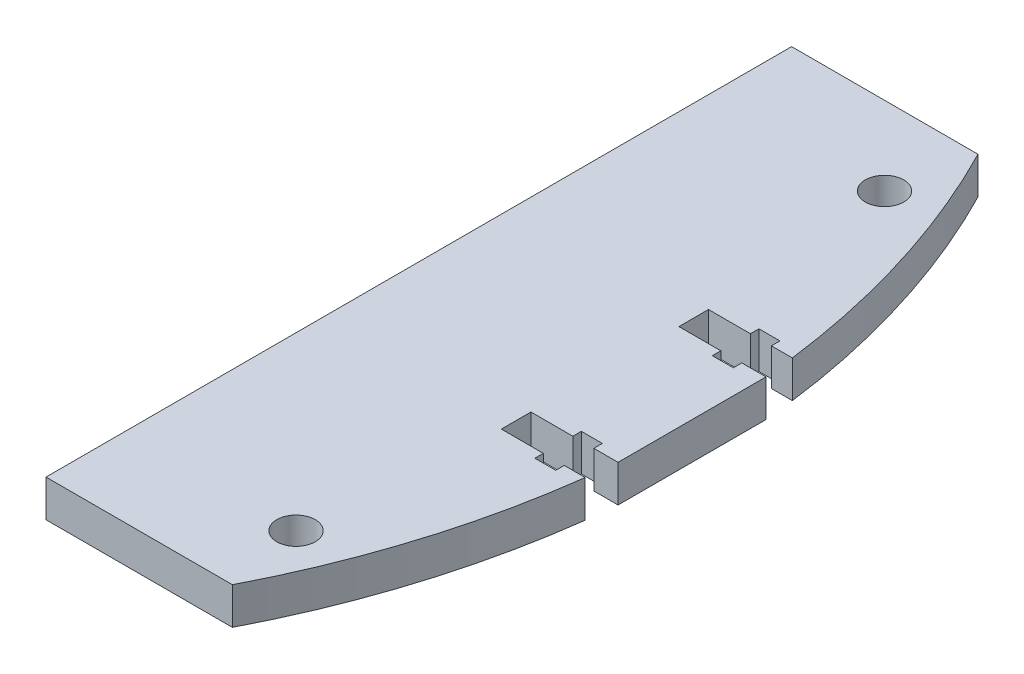
ISO-10303-21;
HEADER;
FILE_DESCRIPTION(('STEP AP214'),'2;1');
FILE_NAME('part.step','',(''),(''),'','','');
FILE_SCHEMA(('AUTOMOTIVE_DESIGN { 1 0 10303 214 1 1 1 1 }'));
ENDSEC;
DATA;
#1=APPLICATION_CONTEXT('core data for automotive mechanical design processes');
#2=APPLICATION_PROTOCOL_DEFINITION('international standard','automotive_design',2000,#1);
#3=PRODUCT_CONTEXT('',#1,'mechanical');
#4=PRODUCT('Part','Part','',(#3));
#5=PRODUCT_RELATED_PRODUCT_CATEGORY('part','',(#4));
#6=PRODUCT_DEFINITION_FORMATION('','',#4);
#7=PRODUCT_DEFINITION_CONTEXT('part definition',#1,'design');
#8=PRODUCT_DEFINITION('design','',#6,#7);
#9=PRODUCT_DEFINITION_SHAPE('','',#8);
#10=(LENGTH_UNIT() NAMED_UNIT(*) SI_UNIT(.MILLI.,.METRE.));
#11=(NAMED_UNIT(*) PLANE_ANGLE_UNIT() SI_UNIT($,.RADIAN.));
#12=(NAMED_UNIT(*) SI_UNIT($,.STERADIAN.) SOLID_ANGLE_UNIT());
#13=UNCERTAINTY_MEASURE_WITH_UNIT(LENGTH_MEASURE(1.E-05),#10,'distance_accuracy_value','');
#14=(GEOMETRIC_REPRESENTATION_CONTEXT(3) GLOBAL_UNCERTAINTY_ASSIGNED_CONTEXT((#13)) GLOBAL_UNIT_ASSIGNED_CONTEXT((#10,
#11,#12)) REPRESENTATION_CONTEXT('',''));
#15=CARTESIAN_POINT('',(0.,0.,0.));
#16=DIRECTION('',(0.,0.,1.));
#17=DIRECTION('',(1.,0.,0.));
#18=AXIS2_PLACEMENT_3D('',#15,#16,#17);
#19=CARTESIAN_POINT('',(0.,3.175,0.));
#20=DIRECTION('',(0.,-1.,0.));
#21=DIRECTION('',(0.,0.,-1.));
#22=AXIS2_PLACEMENT_3D('',#19,#20,#21);
#23=PLANE('',#22);
#24=CARTESIAN_POINT('',(0.,3.175,0.));
#25=DIRECTION('',(0.,1.,0.));
#26=DIRECTION('',(0.,0.,-1.));
#27=AXIS2_PLACEMENT_3D('',#24,#25,#26);
#28=CIRCLE('',#27,70.);
#29=CARTESIAN_POINT('',(69.4331901902829,3.175,-8.89));
#30=VERTEX_POINT('',#29);
#31=CARTESIAN_POINT('',(62.2575296650935,3.175,-32.));
#32=VERTEX_POINT('',#31);
#33=EDGE_CURVE('E305',#30,#32,#28,.T.);
#34=ORIENTED_EDGE('',*,*,#33,.T.);
#35=DIRECTION('',(-1.,0.,0.));
#36=VECTOR('',#35,1.);
#37=CARTESIAN_POINT('',(62.2575296650935,3.175,-32.));
#38=LINE('',#37,#36);
#39=CARTESIAN_POINT('',(46.2575296650935,3.175,-32.));
#40=VERTEX_POINT('',#39);
#41=EDGE_CURVE('E153',#32,#40,#38,.T.);
#42=ORIENTED_EDGE('',*,*,#41,.T.);
#43=DIRECTION('',(0.,0.,1.));
#44=VECTOR('',#43,1.);
#45=CARTESIAN_POINT('',(46.2575296650935,3.175,-32.));
#46=LINE('',#45,#44);
#47=CARTESIAN_POINT('',(46.2575296650936,3.175,32.));
#48=VERTEX_POINT('',#47);
#49=EDGE_CURVE('E380',#40,#48,#46,.T.);
#50=ORIENTED_EDGE('',*,*,#49,.T.);
#51=DIRECTION('',(1.,0.,0.));
#52=VECTOR('',#51,1.);
#53=CARTESIAN_POINT('',(46.2575296650936,3.175,32.));
#54=LINE('',#53,#52);
#55=CARTESIAN_POINT('',(62.2575296650935,3.175,32.));
#56=VERTEX_POINT('',#55);
#57=EDGE_CURVE('E399',#48,#56,#54,.T.);
#58=ORIENTED_EDGE('',*,*,#57,.T.);
#59=CARTESIAN_POINT('',(0.,3.175,0.));
#60=DIRECTION('',(0.,1.,0.));
#61=DIRECTION('',(0.,0.,-1.));
#62=AXIS2_PLACEMENT_3D('',#59,#60,#61);
#63=CIRCLE('',#62,70.);
#64=CARTESIAN_POINT('',(69.4331901902829,3.175,8.89));
#65=VERTEX_POINT('',#64);
#66=EDGE_CURVE('E396',#56,#65,#63,.T.);
#67=ORIENTED_EDGE('',*,*,#66,.T.);
#68=DIRECTION('',(-1.,0.,0.));
#69=VECTOR('',#68,1.);
#70=CARTESIAN_POINT('',(67.6331901902829,3.175,8.89));
#71=LINE('',#70,#69);
#72=CARTESIAN_POINT('',(67.6331901902829,3.175,8.89));
#73=VERTEX_POINT('',#72);
#74=EDGE_CURVE('E398',#65,#73,#71,.T.);
#75=ORIENTED_EDGE('',*,*,#74,.T.);
#76=DIRECTION('',(0.,0.,1.));
#77=VECTOR('',#76,1.);
#78=CARTESIAN_POINT('',(67.6331901902829,3.175,9.62));
#79=LINE('',#78,#77);
#80=CARTESIAN_POINT('',(67.6331901902829,3.175,9.62));
#81=VERTEX_POINT('',#80);
#82=EDGE_CURVE('E401',#73,#81,#79,.T.);
#83=ORIENTED_EDGE('',*,*,#82,.T.);
#84=DIRECTION('',(-1.,0.,0.));
#85=VECTOR('',#84,1.);
#86=CARTESIAN_POINT('',(65.8331901902829,3.175,9.62));
#87=LINE('',#86,#85);
#88=CARTESIAN_POINT('',(65.8331901902829,3.175,9.62));
#89=VERTEX_POINT('',#88);
#90=EDGE_CURVE('E407',#81,#89,#87,.T.);
#91=ORIENTED_EDGE('',*,*,#90,.T.);
#92=DIRECTION('',(0.,0.,-1.));
#93=VECTOR('',#92,1.);
#94=CARTESIAN_POINT('',(65.8331901902829,3.175,8.89));
#95=LINE('',#94,#93);
#96=CARTESIAN_POINT('',(65.8331901902829,3.175,8.89));
#97=VERTEX_POINT('',#96);
#98=EDGE_CURVE('E409',#89,#97,#95,.T.);
#99=ORIENTED_EDGE('',*,*,#98,.T.);
#100=DIRECTION('',(-1.,0.,0.));
#101=VECTOR('',#100,1.);
#102=CARTESIAN_POINT('',(62.2331901902829,3.175,8.89));
#103=LINE('',#102,#101);
#104=CARTESIAN_POINT('',(62.2331901902829,3.175,8.89));
#105=VERTEX_POINT('',#104);
#106=EDGE_CURVE('E411',#97,#105,#103,.T.);
#107=ORIENTED_EDGE('',*,*,#106,.T.);
#108=DIRECTION('',(0.,0.,-1.));
#109=VECTOR('',#108,1.);
#110=CARTESIAN_POINT('',(62.2331901902829,3.175,6.35));
#111=LINE('',#110,#109);
#112=CARTESIAN_POINT('',(62.2331901902829,3.175,6.35));
#113=VERTEX_POINT('',#112);
#114=EDGE_CURVE('E413',#105,#113,#111,.T.);
#115=ORIENTED_EDGE('',*,*,#114,.T.);
#116=DIRECTION('',(1.,0.,0.));
#117=VECTOR('',#116,1.);
#118=CARTESIAN_POINT('',(65.8331901902829,3.175,6.35));
#119=LINE('',#118,#117);
#120=CARTESIAN_POINT('',(65.8331901902829,3.175,6.35));
#121=VERTEX_POINT('',#120);
#122=EDGE_CURVE('E415',#113,#121,#119,.T.);
#123=ORIENTED_EDGE('',*,*,#122,.T.);
#124=DIRECTION('',(0.,0.,-1.));
#125=VECTOR('',#124,1.);
#126=CARTESIAN_POINT('',(65.8331901902829,3.175,5.62));
#127=LINE('',#126,#125);
#128=CARTESIAN_POINT('',(65.8331901902829,3.175,5.62));
#129=VERTEX_POINT('',#128);
#130=EDGE_CURVE('E417',#121,#129,#127,.T.);
#131=ORIENTED_EDGE('',*,*,#130,.T.);
#132=DIRECTION('',(1.,0.,0.));
#133=VECTOR('',#132,1.);
#134=CARTESIAN_POINT('',(67.6331901902829,3.175,5.62));
#135=LINE('',#134,#133);
#136=CARTESIAN_POINT('',(67.6331901902829,3.175,5.62));
#137=VERTEX_POINT('',#136);
#138=EDGE_CURVE('E419',#129,#137,#135,.T.);
#139=ORIENTED_EDGE('',*,*,#138,.T.);
#140=DIRECTION('',(0.,0.,1.));
#141=VECTOR('',#140,1.);
#142=CARTESIAN_POINT('',(67.6331901902829,3.175,6.35));
#143=LINE('',#142,#141);
#144=CARTESIAN_POINT('',(67.6331901902829,3.175,6.35));
#145=VERTEX_POINT('',#144);
#146=EDGE_CURVE('E421',#137,#145,#143,.T.);
#147=ORIENTED_EDGE('',*,*,#146,.T.);
#148=DIRECTION('',(1.,0.,0.));
#149=VECTOR('',#148,1.);
#150=CARTESIAN_POINT('',(69.7113871616395,3.175,6.35));
#151=LINE('',#150,#149);
#152=CARTESIAN_POINT('',(69.7113871616395,3.175,6.35));
#153=VERTEX_POINT('',#152);
#154=EDGE_CURVE('E423',#145,#153,#151,.T.);
#155=ORIENTED_EDGE('',*,*,#154,.T.);
#156=DIRECTION('',(0.,0.,-1.));
#157=VECTOR('',#156,1.);
#158=CARTESIAN_POINT('',(69.7113871616395,3.175,-6.35));
#159=LINE('',#158,#157);
#160=CARTESIAN_POINT('',(69.7113871616395,3.175,-6.35));
#161=VERTEX_POINT('',#160);
#162=EDGE_CURVE('E425',#153,#161,#159,.T.);
#163=ORIENTED_EDGE('',*,*,#162,.T.);
#164=DIRECTION('',(-1.,0.,0.));
#165=VECTOR('',#164,1.);
#166=CARTESIAN_POINT('',(69.7113871616395,3.175,-6.35));
#167=LINE('',#166,#165);
#168=CARTESIAN_POINT('',(67.6331901902829,3.175,-6.35));
#169=VERTEX_POINT('',#168);
#170=EDGE_CURVE('E427',#161,#169,#167,.T.);
#171=ORIENTED_EDGE('',*,*,#170,.T.);
#172=DIRECTION('',(0.,0.,1.));
#173=VECTOR('',#172,1.);
#174=CARTESIAN_POINT('',(67.6331901902829,3.175,-6.35));
#175=LINE('',#174,#173);
#176=CARTESIAN_POINT('',(67.6331901902829,3.175,-5.62));
#177=VERTEX_POINT('',#176);
#178=EDGE_CURVE('E429',#169,#177,#175,.T.);
#179=ORIENTED_EDGE('',*,*,#178,.T.);
#180=DIRECTION('',(-1.,0.,0.));
#181=VECTOR('',#180,1.);
#182=CARTESIAN_POINT('',(67.6331901902829,3.175,-5.62));
#183=LINE('',#182,#181);
#184=CARTESIAN_POINT('',(65.8331901902829,3.175,-5.62));
#185=VERTEX_POINT('',#184);
#186=EDGE_CURVE('E431',#177,#185,#183,.T.);
#187=ORIENTED_EDGE('',*,*,#186,.T.);
#188=DIRECTION('',(0.,0.,-1.));
#189=VECTOR('',#188,1.);
#190=CARTESIAN_POINT('',(65.8331901902829,3.175,-5.62));
#191=LINE('',#190,#189);
#192=CARTESIAN_POINT('',(65.8331901902829,3.175,-6.35));
#193=VERTEX_POINT('',#192);
#194=EDGE_CURVE('E433',#185,#193,#191,.T.);
#195=ORIENTED_EDGE('',*,*,#194,.T.);
#196=DIRECTION('',(-1.,0.,0.));
#197=VECTOR('',#196,1.);
#198=CARTESIAN_POINT('',(65.8331901902829,3.175,-6.35));
#199=LINE('',#198,#197);
#200=CARTESIAN_POINT('',(62.2331901902829,3.175,-6.35));
#201=VERTEX_POINT('',#200);
#202=EDGE_CURVE('E435',#193,#201,#199,.T.);
#203=ORIENTED_EDGE('',*,*,#202,.T.);
#204=DIRECTION('',(0.,0.,-1.));
#205=VECTOR('',#204,1.);
#206=CARTESIAN_POINT('',(62.2331901902829,3.175,-6.35));
#207=LINE('',#206,#205);
#208=CARTESIAN_POINT('',(62.2331901902829,3.175,-8.89));
#209=VERTEX_POINT('',#208);
#210=EDGE_CURVE('E437',#201,#209,#207,.T.);
#211=ORIENTED_EDGE('',*,*,#210,.T.);
#212=DIRECTION('',(1.,0.,0.));
#213=VECTOR('',#212,1.);
#214=CARTESIAN_POINT('',(62.2331901902829,3.175,-8.89));
#215=LINE('',#214,#213);
#216=CARTESIAN_POINT('',(65.8331901902829,3.175,-8.89));
#217=VERTEX_POINT('',#216);
#218=EDGE_CURVE('E439',#209,#217,#215,.T.);
#219=ORIENTED_EDGE('',*,*,#218,.T.);
#220=DIRECTION('',(0.,0.,-1.));
#221=VECTOR('',#220,1.);
#222=CARTESIAN_POINT('',(65.8331901902829,3.175,-8.89));
#223=LINE('',#222,#221);
#224=CARTESIAN_POINT('',(65.8331901902829,3.175,-9.62));
#225=VERTEX_POINT('',#224);
#226=EDGE_CURVE('E232',#217,#225,#223,.T.);
#227=ORIENTED_EDGE('',*,*,#226,.T.);
#228=DIRECTION('',(1.,0.,0.));
#229=VECTOR('',#228,1.);
#230=CARTESIAN_POINT('',(65.8331901902829,3.175,-9.62));
#231=LINE('',#230,#229);
#232=CARTESIAN_POINT('',(67.6331901902829,3.175,-9.62));
#233=VERTEX_POINT('',#232);
#234=EDGE_CURVE('E226',#225,#233,#231,.T.);
#235=ORIENTED_EDGE('',*,*,#234,.T.);
#236=DIRECTION('',(0.,0.,1.));
#237=VECTOR('',#236,1.);
#238=CARTESIAN_POINT('',(67.6331901902829,3.175,-9.62));
#239=LINE('',#238,#237);
#240=CARTESIAN_POINT('',(67.6331901902829,3.175,-8.89));
#241=VERTEX_POINT('',#240);
#242=EDGE_CURVE('E230',#233,#241,#239,.T.);
#243=ORIENTED_EDGE('',*,*,#242,.T.);
#244=DIRECTION('',(1.,0.,0.));
#245=VECTOR('',#244,1.);
#246=CARTESIAN_POINT('',(67.6331901902829,3.175,-8.89));
#247=LINE('',#246,#245);
#248=EDGE_CURVE('E50',#241,#30,#247,.T.);
#249=ORIENTED_EDGE('',*,*,#248,.T.);
#250=EDGE_LOOP('',(#34,#42,#50,#58,#67,#75,#83,#91,#99,#107,#115,#123,#131,#139,#147,#155,#163,
#171,#179,#187,#195,#203,#211,#219,#227,#235,#243,#249));
#251=FACE_BOUND('',#250,.T.);
#252=CARTESIAN_POINT('',(60.9760491457449,3.175,25.257106536096));
#253=DIRECTION('',(0.,1.,0.));
#254=DIRECTION('',(0.,0.,1.));
#255=AXIS2_PLACEMENT_3D('',#252,#253,#254);
#256=CIRCLE('',#255,1.65);
#257=CARTESIAN_POINT('',(60.9760491457449,3.175,26.907106536096));
#258=VERTEX_POINT('',#257);
#259=EDGE_CURVE('E254',#258,#258,#256,.T.);
#260=ORIENTED_EDGE('',*,*,#259,.F.);
#261=EDGE_LOOP('',(#260));
#262=FACE_BOUND('',#261,.T.);
#263=CARTESIAN_POINT('',(60.9760491457449,3.175,-25.257106536096));
#264=DIRECTION('',(0.,1.,0.));
#265=DIRECTION('',(0.,0.,1.));
#266=AXIS2_PLACEMENT_3D('',#263,#264,#265);
#267=CIRCLE('',#266,1.65);
#268=CARTESIAN_POINT('',(60.9760491457449,3.175,-23.607106536096));
#269=VERTEX_POINT('',#268);
#270=EDGE_CURVE('E480',#269,#269,#267,.T.);
#271=ORIENTED_EDGE('',*,*,#270,.F.);
#272=EDGE_LOOP('',(#271));
#273=FACE_BOUND('',#272,.T.);
#274=ADVANCED_FACE('F33',(#251,#262,#273),#23,.F.);
#275=CARTESIAN_POINT('',(0.,0.,0.));
#276=DIRECTION('',(0.,-1.,0.));
#277=DIRECTION('',(0.,0.,-1.));
#278=AXIS2_PLACEMENT_3D('',#275,#276,#277);
#279=PLANE('',#278);
#280=CARTESIAN_POINT('',(60.9760491457449,0.,25.257106536096));
#281=DIRECTION('',(0.,1.,0.));
#282=DIRECTION('',(0.,0.,1.));
#283=AXIS2_PLACEMENT_3D('',#280,#281,#282);
#284=CIRCLE('',#283,1.65);
#285=CARTESIAN_POINT('',(60.9760491457449,0.,26.907106536096));
#286=VERTEX_POINT('',#285);
#287=EDGE_CURVE('E485',#286,#286,#284,.T.);
#288=ORIENTED_EDGE('',*,*,#287,.T.);
#289=EDGE_LOOP('',(#288));
#290=FACE_BOUND('',#289,.T.);
#291=CARTESIAN_POINT('',(0.,0.,0.));
#292=DIRECTION('',(0.,1.,0.));
#293=DIRECTION('',(0.,0.,-1.));
#294=AXIS2_PLACEMENT_3D('',#291,#292,#293);
#295=CIRCLE('',#294,70.);
#296=CARTESIAN_POINT('',(69.4331901902829,0.,-8.89));
#297=VERTEX_POINT('',#296);
#298=CARTESIAN_POINT('',(62.2575296650935,0.,-32.));
#299=VERTEX_POINT('',#298);
#300=EDGE_CURVE('E250',#297,#299,#295,.T.);
#301=ORIENTED_EDGE('',*,*,#300,.F.);
#302=DIRECTION('',(1.,0.,0.));
#303=VECTOR('',#302,1.);
#304=CARTESIAN_POINT('',(67.6331901902829,0.,-8.89));
#305=LINE('',#304,#303);
#306=CARTESIAN_POINT('',(67.6331901902829,0.,-8.89));
#307=VERTEX_POINT('',#306);
#308=EDGE_CURVE('E145',#307,#297,#305,.T.);
#309=ORIENTED_EDGE('',*,*,#308,.F.);
#310=DIRECTION('',(0.,0.,1.));
#311=VECTOR('',#310,1.);
#312=CARTESIAN_POINT('',(67.6331901902829,0.,-9.62));
#313=LINE('',#312,#311);
#314=CARTESIAN_POINT('',(67.6331901902829,0.,-9.62));
#315=VERTEX_POINT('',#314);
#316=EDGE_CURVE('E139',#315,#307,#313,.T.);
#317=ORIENTED_EDGE('',*,*,#316,.F.);
#318=DIRECTION('',(1.,0.,0.));
#319=VECTOR('',#318,1.);
#320=CARTESIAN_POINT('',(65.8331901902829,0.,-9.62));
#321=LINE('',#320,#319);
#322=CARTESIAN_POINT('',(65.8331901902829,0.,-9.62));
#323=VERTEX_POINT('',#322);
#324=EDGE_CURVE('E240',#323,#315,#321,.T.);
#325=ORIENTED_EDGE('',*,*,#324,.F.);
#326=DIRECTION('',(0.,0.,-1.));
#327=VECTOR('',#326,1.);
#328=CARTESIAN_POINT('',(65.8331901902829,0.,-8.89));
#329=LINE('',#328,#327);
#330=CARTESIAN_POINT('',(65.8331901902829,0.,-8.89));
#331=VERTEX_POINT('',#330);
#332=EDGE_CURVE('E300',#331,#323,#329,.T.);
#333=ORIENTED_EDGE('',*,*,#332,.F.);
#334=DIRECTION('',(1.,0.,0.));
#335=VECTOR('',#334,1.);
#336=CARTESIAN_POINT('',(62.2331901902829,0.,-8.89));
#337=LINE('',#336,#335);
#338=CARTESIAN_POINT('',(62.2331901902829,0.,-8.89));
#339=VERTEX_POINT('',#338);
#340=EDGE_CURVE('E298',#339,#331,#337,.T.);
#341=ORIENTED_EDGE('',*,*,#340,.F.);
#342=DIRECTION('',(0.,0.,-1.));
#343=VECTOR('',#342,1.);
#344=CARTESIAN_POINT('',(62.2331901902829,0.,-6.35));
#345=LINE('',#344,#343);
#346=CARTESIAN_POINT('',(62.2331901902829,0.,-6.35));
#347=VERTEX_POINT('',#346);
#348=EDGE_CURVE('E296',#347,#339,#345,.T.);
#349=ORIENTED_EDGE('',*,*,#348,.F.);
#350=DIRECTION('',(-1.,0.,0.));
#351=VECTOR('',#350,1.);
#352=CARTESIAN_POINT('',(65.8331901902829,0.,-6.35));
#353=LINE('',#352,#351);
#354=CARTESIAN_POINT('',(65.8331901902829,0.,-6.35));
#355=VERTEX_POINT('',#354);
#356=EDGE_CURVE('E294',#355,#347,#353,.T.);
#357=ORIENTED_EDGE('',*,*,#356,.F.);
#358=DIRECTION('',(0.,0.,-1.));
#359=VECTOR('',#358,1.);
#360=CARTESIAN_POINT('',(65.8331901902829,0.,-5.62));
#361=LINE('',#360,#359);
#362=CARTESIAN_POINT('',(65.8331901902829,0.,-5.62));
#363=VERTEX_POINT('',#362);
#364=EDGE_CURVE('E292',#363,#355,#361,.T.);
#365=ORIENTED_EDGE('',*,*,#364,.F.);
#366=DIRECTION('',(-1.,0.,0.));
#367=VECTOR('',#366,1.);
#368=CARTESIAN_POINT('',(67.6331901902829,0.,-5.62));
#369=LINE('',#368,#367);
#370=CARTESIAN_POINT('',(67.6331901902829,0.,-5.62));
#371=VERTEX_POINT('',#370);
#372=EDGE_CURVE('E290',#371,#363,#369,.T.);
#373=ORIENTED_EDGE('',*,*,#372,.F.);
#374=DIRECTION('',(0.,0.,1.));
#375=VECTOR('',#374,1.);
#376=CARTESIAN_POINT('',(67.6331901902829,0.,-6.35));
#377=LINE('',#376,#375);
#378=CARTESIAN_POINT('',(67.6331901902829,0.,-6.35));
#379=VERTEX_POINT('',#378);
#380=EDGE_CURVE('E288',#379,#371,#377,.T.);
#381=ORIENTED_EDGE('',*,*,#380,.F.);
#382=DIRECTION('',(-1.,0.,0.));
#383=VECTOR('',#382,1.);
#384=CARTESIAN_POINT('',(69.7113871616395,0.,-6.35));
#385=LINE('',#384,#383);
#386=CARTESIAN_POINT('',(69.7113871616395,0.,-6.35));
#387=VERTEX_POINT('',#386);
#388=EDGE_CURVE('E286',#387,#379,#385,.T.);
#389=ORIENTED_EDGE('',*,*,#388,.F.);
#390=DIRECTION('',(0.,0.,-1.));
#391=VECTOR('',#390,1.);
#392=CARTESIAN_POINT('',(69.7113871616395,0.,-6.35));
#393=LINE('',#392,#391);
#394=CARTESIAN_POINT('',(69.7113871616395,0.,6.35));
#395=VERTEX_POINT('',#394);
#396=EDGE_CURVE('E284',#395,#387,#393,.T.);
#397=ORIENTED_EDGE('',*,*,#396,.F.);
#398=DIRECTION('',(1.,0.,0.));
#399=VECTOR('',#398,1.);
#400=CARTESIAN_POINT('',(69.7113871616395,0.,6.35));
#401=LINE('',#400,#399);
#402=CARTESIAN_POINT('',(67.6331901902829,0.,6.35));
#403=VERTEX_POINT('',#402);
#404=EDGE_CURVE('E282',#403,#395,#401,.T.);
#405=ORIENTED_EDGE('',*,*,#404,.F.);
#406=DIRECTION('',(0.,0.,1.));
#407=VECTOR('',#406,1.);
#408=CARTESIAN_POINT('',(67.6331901902829,0.,6.35));
#409=LINE('',#408,#407);
#410=CARTESIAN_POINT('',(67.6331901902829,0.,5.62));
#411=VERTEX_POINT('',#410);
#412=EDGE_CURVE('E280',#411,#403,#409,.T.);
#413=ORIENTED_EDGE('',*,*,#412,.F.);
#414=DIRECTION('',(1.,0.,0.));
#415=VECTOR('',#414,1.);
#416=CARTESIAN_POINT('',(67.6331901902829,0.,5.62));
#417=LINE('',#416,#415);
#418=CARTESIAN_POINT('',(65.8331901902829,0.,5.62));
#419=VERTEX_POINT('',#418);
#420=EDGE_CURVE('E278',#419,#411,#417,.T.);
#421=ORIENTED_EDGE('',*,*,#420,.F.);
#422=DIRECTION('',(0.,0.,-1.));
#423=VECTOR('',#422,1.);
#424=CARTESIAN_POINT('',(65.8331901902829,0.,5.62));
#425=LINE('',#424,#423);
#426=CARTESIAN_POINT('',(65.8331901902829,0.,6.35));
#427=VERTEX_POINT('',#426);
#428=EDGE_CURVE('E276',#427,#419,#425,.T.);
#429=ORIENTED_EDGE('',*,*,#428,.F.);
#430=DIRECTION('',(1.,0.,0.));
#431=VECTOR('',#430,1.);
#432=CARTESIAN_POINT('',(65.8331901902829,0.,6.35));
#433=LINE('',#432,#431);
#434=CARTESIAN_POINT('',(62.2331901902829,0.,6.35));
#435=VERTEX_POINT('',#434);
#436=EDGE_CURVE('E274',#435,#427,#433,.T.);
#437=ORIENTED_EDGE('',*,*,#436,.F.);
#438=DIRECTION('',(0.,0.,-1.));
#439=VECTOR('',#438,1.);
#440=CARTESIAN_POINT('',(62.2331901902829,0.,6.35));
#441=LINE('',#440,#439);
#442=CARTESIAN_POINT('',(62.2331901902829,0.,8.89));
#443=VERTEX_POINT('',#442);
#444=EDGE_CURVE('E272',#443,#435,#441,.T.);
#445=ORIENTED_EDGE('',*,*,#444,.F.);
#446=DIRECTION('',(-1.,0.,0.));
#447=VECTOR('',#446,1.);
#448=CARTESIAN_POINT('',(62.2331901902829,0.,8.89));
#449=LINE('',#448,#447);
#450=CARTESIAN_POINT('',(65.8331901902829,0.,8.89));
#451=VERTEX_POINT('',#450);
#452=EDGE_CURVE('E270',#451,#443,#449,.T.);
#453=ORIENTED_EDGE('',*,*,#452,.F.);
#454=DIRECTION('',(0.,0.,-1.));
#455=VECTOR('',#454,1.);
#456=CARTESIAN_POINT('',(65.8331901902829,0.,8.89));
#457=LINE('',#456,#455);
#458=CARTESIAN_POINT('',(65.8331901902829,0.,9.62));
#459=VERTEX_POINT('',#458);
#460=EDGE_CURVE('E268',#459,#451,#457,.T.);
#461=ORIENTED_EDGE('',*,*,#460,.F.);
#462=DIRECTION('',(-1.,0.,0.));
#463=VECTOR('',#462,1.);
#464=CARTESIAN_POINT('',(65.8331901902829,0.,9.62));
#465=LINE('',#464,#463);
#466=CARTESIAN_POINT('',(67.6331901902829,0.,9.62));
#467=VERTEX_POINT('',#466);
#468=EDGE_CURVE('E266',#467,#459,#465,.T.);
#469=ORIENTED_EDGE('',*,*,#468,.F.);
#470=DIRECTION('',(0.,0.,1.));
#471=VECTOR('',#470,1.);
#472=CARTESIAN_POINT('',(67.6331901902829,0.,9.62));
#473=LINE('',#472,#471);
#474=CARTESIAN_POINT('',(67.6331901902829,0.,8.89));
#475=VERTEX_POINT('',#474);
#476=EDGE_CURVE('E264',#475,#467,#473,.T.);
#477=ORIENTED_EDGE('',*,*,#476,.F.);
#478=DIRECTION('',(-1.,0.,0.));
#479=VECTOR('',#478,1.);
#480=CARTESIAN_POINT('',(67.6331901902829,0.,8.89));
#481=LINE('',#480,#479);
#482=CARTESIAN_POINT('',(69.4331901902829,0.,8.89));
#483=VERTEX_POINT('',#482);
#484=EDGE_CURVE('E262',#483,#475,#481,.T.);
#485=ORIENTED_EDGE('',*,*,#484,.F.);
#486=CARTESIAN_POINT('',(0.,0.,0.));
#487=DIRECTION('',(0.,1.,0.));
#488=DIRECTION('',(0.,0.,-1.));
#489=AXIS2_PLACEMENT_3D('',#486,#487,#488);
#490=CIRCLE('',#489,70.);
#491=CARTESIAN_POINT('',(62.2575296650935,0.,32.));
#492=VERTEX_POINT('',#491);
#493=EDGE_CURVE('E260',#492,#483,#490,.T.);
#494=ORIENTED_EDGE('',*,*,#493,.F.);
#495=DIRECTION('',(1.,0.,0.));
#496=VECTOR('',#495,1.);
#497=CARTESIAN_POINT('',(46.2575296650936,0.,32.));
#498=LINE('',#497,#496);
#499=CARTESIAN_POINT('',(46.2575296650936,0.,32.));
#500=VERTEX_POINT('',#499);
#501=EDGE_CURVE('E258',#500,#492,#498,.T.);
#502=ORIENTED_EDGE('',*,*,#501,.F.);
#503=DIRECTION('',(0.,0.,1.));
#504=VECTOR('',#503,1.);
#505=CARTESIAN_POINT('',(46.2575296650935,0.,-32.));
#506=LINE('',#505,#504);
#507=CARTESIAN_POINT('',(46.2575296650935,0.,-32.));
#508=VERTEX_POINT('',#507);
#509=EDGE_CURVE('E256',#508,#500,#506,.T.);
#510=ORIENTED_EDGE('',*,*,#509,.F.);
#511=DIRECTION('',(-1.,0.,0.));
#512=VECTOR('',#511,1.);
#513=CARTESIAN_POINT('',(62.2575296650935,0.,-32.));
#514=LINE('',#513,#512);
#515=EDGE_CURVE('E253',#299,#508,#514,.T.);
#516=ORIENTED_EDGE('',*,*,#515,.F.);
#517=EDGE_LOOP('',(#301,#309,#317,#325,#333,#341,#349,#357,#365,#373,#381,#389,#397,#405,#413,
#421,#429,#437,#445,#453,#461,#469,#477,#485,#494,#502,#510,#516));
#518=FACE_BOUND('',#517,.T.);
#519=CARTESIAN_POINT('',(60.9760491457449,0.,-25.257106536096));
#520=DIRECTION('',(0.,1.,0.));
#521=DIRECTION('',(0.,0.,1.));
#522=AXIS2_PLACEMENT_3D('',#519,#520,#521);
#523=CIRCLE('',#522,1.65);
#524=CARTESIAN_POINT('',(60.9760491457449,0.,-23.607106536096));
#525=VERTEX_POINT('',#524);
#526=EDGE_CURVE('E483',#525,#525,#523,.T.);
#527=ORIENTED_EDGE('',*,*,#526,.T.);
#528=EDGE_LOOP('',(#527));
#529=FACE_BOUND('',#528,.T.);
#530=ADVANCED_FACE('F384',(#290,#518,#529),#279,.T.);
#531=CARTESIAN_POINT('',(0.,3.175,0.));
#532=DIRECTION('',(0.,-1.,0.));
#533=DIRECTION('',(0.,0.,-1.));
#534=AXIS2_PLACEMENT_3D('',#531,#532,#533);
#535=CYLINDRICAL_SURFACE('',#534,70.);
#536=ORIENTED_EDGE('',*,*,#300,.T.);
#537=DIRECTION('',(0.,-1.,0.));
#538=VECTOR('',#537,1.);
#539=CARTESIAN_POINT('',(62.2575296650935,3.175,-32.));
#540=LINE('',#539,#538);
#541=EDGE_CURVE('E11',#32,#299,#540,.T.);
#542=ORIENTED_EDGE('',*,*,#541,.F.);
#543=ORIENTED_EDGE('',*,*,#33,.F.);
#544=DIRECTION('',(0.,-1.,0.));
#545=VECTOR('',#544,1.);
#546=CARTESIAN_POINT('',(69.4331901902829,3.175,-8.89));
#547=LINE('',#546,#545);
#548=EDGE_CURVE('E246',#30,#297,#547,.T.);
#549=ORIENTED_EDGE('',*,*,#548,.T.);
#550=EDGE_LOOP('',(#536,#542,#543,#549));
#551=FACE_BOUND('',#550,.T.);
#552=ADVANCED_FACE('F35',(#551),#535,.T.);
#553=CARTESIAN_POINT('',(62.2575296650935,3.175,-32.));
#554=DIRECTION('',(0.,0.,1.));
#555=DIRECTION('',(1.,0.,0.));
#556=AXIS2_PLACEMENT_3D('',#553,#554,#555);
#557=PLANE('',#556);
#558=ORIENTED_EDGE('',*,*,#515,.T.);
#559=DIRECTION('',(0.,-1.,0.));
#560=VECTOR('',#559,1.);
#561=CARTESIAN_POINT('',(46.2575296650935,3.175,-32.));
#562=LINE('',#561,#560);
#563=EDGE_CURVE('E42',#40,#508,#562,.T.);
#564=ORIENTED_EDGE('',*,*,#563,.F.);
#565=ORIENTED_EDGE('',*,*,#41,.F.);
#566=ORIENTED_EDGE('',*,*,#541,.T.);
#567=EDGE_LOOP('',(#558,#564,#565,#566));
#568=FACE_BOUND('',#567,.T.);
#569=ADVANCED_FACE('F740',(#568),#557,.F.);
#570=CARTESIAN_POINT('',(46.2575296650935,3.175,-32.));
#571=DIRECTION('',(1.,0.,0.));
#572=DIRECTION('',(0.,0.,-1.));
#573=AXIS2_PLACEMENT_3D('',#570,#571,#572);
#574=PLANE('',#573);
#575=ORIENTED_EDGE('',*,*,#509,.T.);
#576=DIRECTION('',(0.,-1.,0.));
#577=VECTOR('',#576,1.);
#578=CARTESIAN_POINT('',(46.2575296650936,3.175,32.));
#579=LINE('',#578,#577);
#580=EDGE_CURVE('E372',#48,#500,#579,.T.);
#581=ORIENTED_EDGE('',*,*,#580,.F.);
#582=ORIENTED_EDGE('',*,*,#49,.F.);
#583=ORIENTED_EDGE('',*,*,#563,.T.);
#584=EDGE_LOOP('',(#575,#581,#582,#583));
#585=FACE_BOUND('',#584,.T.);
#586=ADVANCED_FACE('F378',(#585),#574,.F.);
#587=CARTESIAN_POINT('',(46.2575296650936,3.175,32.));
#588=DIRECTION('',(0.,0.,-1.));
#589=DIRECTION('',(-1.,0.,0.));
#590=AXIS2_PLACEMENT_3D('',#587,#588,#589);
#591=PLANE('',#590);
#592=ORIENTED_EDGE('',*,*,#501,.T.);
#593=DIRECTION('',(0.,-1.,0.));
#594=VECTOR('',#593,1.);
#595=CARTESIAN_POINT('',(62.2575296650935,3.175,32.));
#596=LINE('',#595,#594);
#597=EDGE_CURVE('E369',#56,#492,#596,.T.);
#598=ORIENTED_EDGE('',*,*,#597,.F.);
#599=ORIENTED_EDGE('',*,*,#57,.F.);
#600=ORIENTED_EDGE('',*,*,#580,.T.);
#601=EDGE_LOOP('',(#592,#598,#599,#600));
#602=FACE_BOUND('',#601,.T.);
#603=ADVANCED_FACE('F390',(#602),#591,.F.);
#604=CARTESIAN_POINT('',(0.,3.175,0.));
#605=DIRECTION('',(0.,-1.,0.));
#606=DIRECTION('',(0.,0.,-1.));
#607=AXIS2_PLACEMENT_3D('',#604,#605,#606);
#608=CYLINDRICAL_SURFACE('',#607,70.);
#609=ORIENTED_EDGE('',*,*,#493,.T.);
#610=DIRECTION('',(0.,-1.,0.));
#611=VECTOR('',#610,1.);
#612=CARTESIAN_POINT('',(69.4331901902829,3.175,8.89));
#613=LINE('',#612,#611);
#614=EDGE_CURVE('E366',#65,#483,#613,.T.);
#615=ORIENTED_EDGE('',*,*,#614,.F.);
#616=ORIENTED_EDGE('',*,*,#66,.F.);
#617=ORIENTED_EDGE('',*,*,#597,.T.);
#618=EDGE_LOOP('',(#609,#615,#616,#617));
#619=FACE_BOUND('',#618,.T.);
#620=ADVANCED_FACE('F394',(#619),#608,.T.);
#621=CARTESIAN_POINT('',(67.6331901902829,3.175,8.89));
#622=DIRECTION('',(0.,0.,1.));
#623=DIRECTION('',(1.,0.,0.));
#624=AXIS2_PLACEMENT_3D('',#621,#622,#623);
#625=PLANE('',#624);
#626=ORIENTED_EDGE('',*,*,#484,.T.);
#627=DIRECTION('',(0.,-1.,0.));
#628=VECTOR('',#627,1.);
#629=CARTESIAN_POINT('',(67.6331901902829,3.175,8.89));
#630=LINE('',#629,#628);
#631=EDGE_CURVE('E363',#73,#475,#630,.T.);
#632=ORIENTED_EDGE('',*,*,#631,.F.);
#633=ORIENTED_EDGE('',*,*,#74,.F.);
#634=ORIENTED_EDGE('',*,*,#614,.T.);
#635=EDGE_LOOP('',(#626,#632,#633,#634));
#636=FACE_BOUND('',#635,.T.);
#637=ADVANCED_FACE('F705',(#636),#625,.F.);
#638=CARTESIAN_POINT('',(67.6331901902829,3.175,9.62));
#639=DIRECTION('',(1.,0.,0.));
#640=DIRECTION('',(0.,0.,-1.));
#641=AXIS2_PLACEMENT_3D('',#638,#639,#640);
#642=PLANE('',#641);
#643=ORIENTED_EDGE('',*,*,#476,.T.);
#644=DIRECTION('',(0.,-1.,0.));
#645=VECTOR('',#644,1.);
#646=CARTESIAN_POINT('',(67.6331901902829,3.175,9.62));
#647=LINE('',#646,#645);
#648=EDGE_CURVE('E360',#81,#467,#647,.T.);
#649=ORIENTED_EDGE('',*,*,#648,.F.);
#650=ORIENTED_EDGE('',*,*,#82,.F.);
#651=ORIENTED_EDGE('',*,*,#631,.T.);
#652=EDGE_LOOP('',(#643,#649,#650,#651));
#653=FACE_BOUND('',#652,.T.);
#654=ADVANCED_FACE('F695',(#653),#642,.F.);
#655=CARTESIAN_POINT('',(65.8331901902829,3.175,9.62));
#656=DIRECTION('',(0.,0.,1.));
#657=DIRECTION('',(1.,0.,0.));
#658=AXIS2_PLACEMENT_3D('',#655,#656,#657);
#659=PLANE('',#658);
#660=ORIENTED_EDGE('',*,*,#468,.T.);
#661=DIRECTION('',(0.,-1.,0.));
#662=VECTOR('',#661,1.);
#663=CARTESIAN_POINT('',(65.8331901902829,3.175,9.62));
#664=LINE('',#663,#662);
#665=EDGE_CURVE('E357',#89,#459,#664,.T.);
#666=ORIENTED_EDGE('',*,*,#665,.F.);
#667=ORIENTED_EDGE('',*,*,#90,.F.);
#668=ORIENTED_EDGE('',*,*,#648,.T.);
#669=EDGE_LOOP('',(#660,#666,#667,#668));
#670=FACE_BOUND('',#669,.T.);
#671=ADVANCED_FACE('F685',(#670),#659,.F.);
#672=CARTESIAN_POINT('',(65.8331901902829,3.175,8.89));
#673=DIRECTION('',(-1.,0.,0.));
#674=DIRECTION('',(0.,0.,1.));
#675=AXIS2_PLACEMENT_3D('',#672,#673,#674);
#676=PLANE('',#675);
#677=ORIENTED_EDGE('',*,*,#460,.T.);
#678=DIRECTION('',(0.,-1.,0.));
#679=VECTOR('',#678,1.);
#680=CARTESIAN_POINT('',(65.8331901902829,3.175,8.89));
#681=LINE('',#680,#679);
#682=EDGE_CURVE('E354',#97,#451,#681,.T.);
#683=ORIENTED_EDGE('',*,*,#682,.F.);
#684=ORIENTED_EDGE('',*,*,#98,.F.);
#685=ORIENTED_EDGE('',*,*,#665,.T.);
#686=EDGE_LOOP('',(#677,#683,#684,#685));
#687=FACE_BOUND('',#686,.T.);
#688=ADVANCED_FACE('F675',(#687),#676,.F.);
#689=CARTESIAN_POINT('',(62.2331901902829,3.175,8.89));
#690=DIRECTION('',(0.,0.,1.));
#691=DIRECTION('',(1.,0.,0.));
#692=AXIS2_PLACEMENT_3D('',#689,#690,#691);
#693=PLANE('',#692);
#694=ORIENTED_EDGE('',*,*,#452,.T.);
#695=DIRECTION('',(0.,-1.,0.));
#696=VECTOR('',#695,1.);
#697=CARTESIAN_POINT('',(62.2331901902829,3.175,8.89));
#698=LINE('',#697,#696);
#699=EDGE_CURVE('E351',#105,#443,#698,.T.);
#700=ORIENTED_EDGE('',*,*,#699,.F.);
#701=ORIENTED_EDGE('',*,*,#106,.F.);
#702=ORIENTED_EDGE('',*,*,#682,.T.);
#703=EDGE_LOOP('',(#694,#700,#701,#702));
#704=FACE_BOUND('',#703,.T.);
#705=ADVANCED_FACE('F665',(#704),#693,.F.);
#706=CARTESIAN_POINT('',(62.2331901902829,3.175,6.35));
#707=DIRECTION('',(-1.,0.,0.));
#708=DIRECTION('',(0.,0.,1.));
#709=AXIS2_PLACEMENT_3D('',#706,#707,#708);
#710=PLANE('',#709);
#711=ORIENTED_EDGE('',*,*,#444,.T.);
#712=DIRECTION('',(0.,-1.,0.));
#713=VECTOR('',#712,1.);
#714=CARTESIAN_POINT('',(62.2331901902829,3.175,6.35));
#715=LINE('',#714,#713);
#716=EDGE_CURVE('E348',#113,#435,#715,.T.);
#717=ORIENTED_EDGE('',*,*,#716,.F.);
#718=ORIENTED_EDGE('',*,*,#114,.F.);
#719=ORIENTED_EDGE('',*,*,#699,.T.);
#720=EDGE_LOOP('',(#711,#717,#718,#719));
#721=FACE_BOUND('',#720,.T.);
#722=ADVANCED_FACE('F655',(#721),#710,.F.);
#723=CARTESIAN_POINT('',(65.8331901902829,3.175,6.35));
#724=DIRECTION('',(0.,0.,-1.));
#725=DIRECTION('',(-1.,0.,0.));
#726=AXIS2_PLACEMENT_3D('',#723,#724,#725);
#727=PLANE('',#726);
#728=ORIENTED_EDGE('',*,*,#436,.T.);
#729=DIRECTION('',(0.,-1.,0.));
#730=VECTOR('',#729,1.);
#731=CARTESIAN_POINT('',(65.8331901902829,3.175,6.35));
#732=LINE('',#731,#730);
#733=EDGE_CURVE('E345',#121,#427,#732,.T.);
#734=ORIENTED_EDGE('',*,*,#733,.F.);
#735=ORIENTED_EDGE('',*,*,#122,.F.);
#736=ORIENTED_EDGE('',*,*,#716,.T.);
#737=EDGE_LOOP('',(#728,#734,#735,#736));
#738=FACE_BOUND('',#737,.T.);
#739=ADVANCED_FACE('F645',(#738),#727,.F.);
#740=CARTESIAN_POINT('',(65.8331901902829,3.175,5.62));
#741=DIRECTION('',(-1.,0.,0.));
#742=DIRECTION('',(0.,0.,1.));
#743=AXIS2_PLACEMENT_3D('',#740,#741,#742);
#744=PLANE('',#743);
#745=ORIENTED_EDGE('',*,*,#428,.T.);
#746=DIRECTION('',(0.,-1.,0.));
#747=VECTOR('',#746,1.);
#748=CARTESIAN_POINT('',(65.8331901902829,3.175,5.62));
#749=LINE('',#748,#747);
#750=EDGE_CURVE('E342',#129,#419,#749,.T.);
#751=ORIENTED_EDGE('',*,*,#750,.F.);
#752=ORIENTED_EDGE('',*,*,#130,.F.);
#753=ORIENTED_EDGE('',*,*,#733,.T.);
#754=EDGE_LOOP('',(#745,#751,#752,#753));
#755=FACE_BOUND('',#754,.T.);
#756=ADVANCED_FACE('F635',(#755),#744,.F.);
#757=CARTESIAN_POINT('',(67.6331901902829,3.175,5.62));
#758=DIRECTION('',(0.,0.,-1.));
#759=DIRECTION('',(-1.,0.,0.));
#760=AXIS2_PLACEMENT_3D('',#757,#758,#759);
#761=PLANE('',#760);
#762=ORIENTED_EDGE('',*,*,#420,.T.);
#763=DIRECTION('',(0.,-1.,0.));
#764=VECTOR('',#763,1.);
#765=CARTESIAN_POINT('',(67.6331901902829,3.175,5.62));
#766=LINE('',#765,#764);
#767=EDGE_CURVE('E339',#137,#411,#766,.T.);
#768=ORIENTED_EDGE('',*,*,#767,.F.);
#769=ORIENTED_EDGE('',*,*,#138,.F.);
#770=ORIENTED_EDGE('',*,*,#750,.T.);
#771=EDGE_LOOP('',(#762,#768,#769,#770));
#772=FACE_BOUND('',#771,.T.);
#773=ADVANCED_FACE('F625',(#772),#761,.F.);
#774=CARTESIAN_POINT('',(67.6331901902829,3.175,6.35));
#775=DIRECTION('',(1.,0.,0.));
#776=DIRECTION('',(0.,0.,-1.));
#777=AXIS2_PLACEMENT_3D('',#774,#775,#776);
#778=PLANE('',#777);
#779=ORIENTED_EDGE('',*,*,#412,.T.);
#780=DIRECTION('',(0.,-1.,0.));
#781=VECTOR('',#780,1.);
#782=CARTESIAN_POINT('',(67.6331901902829,3.175,6.35));
#783=LINE('',#782,#781);
#784=EDGE_CURVE('E336',#145,#403,#783,.T.);
#785=ORIENTED_EDGE('',*,*,#784,.F.);
#786=ORIENTED_EDGE('',*,*,#146,.F.);
#787=ORIENTED_EDGE('',*,*,#767,.T.);
#788=EDGE_LOOP('',(#779,#785,#786,#787));
#789=FACE_BOUND('',#788,.T.);
#790=ADVANCED_FACE('F615',(#789),#778,.F.);
#791=CARTESIAN_POINT('',(69.7113871616395,3.175,6.35));
#792=DIRECTION('',(0.,0.,-1.));
#793=DIRECTION('',(-1.,0.,0.));
#794=AXIS2_PLACEMENT_3D('',#791,#792,#793);
#795=PLANE('',#794);
#796=ORIENTED_EDGE('',*,*,#404,.T.);
#797=DIRECTION('',(0.,-1.,0.));
#798=VECTOR('',#797,1.);
#799=CARTESIAN_POINT('',(69.7113871616395,3.175,6.35));
#800=LINE('',#799,#798);
#801=EDGE_CURVE('E333',#153,#395,#800,.T.);
#802=ORIENTED_EDGE('',*,*,#801,.F.);
#803=ORIENTED_EDGE('',*,*,#154,.F.);
#804=ORIENTED_EDGE('',*,*,#784,.T.);
#805=EDGE_LOOP('',(#796,#802,#803,#804));
#806=FACE_BOUND('',#805,.T.);
#807=ADVANCED_FACE('F605',(#806),#795,.F.);
#808=CARTESIAN_POINT('',(69.7113871616395,3.175,-6.35));
#809=DIRECTION('',(-1.,0.,0.));
#810=DIRECTION('',(0.,0.,1.));
#811=AXIS2_PLACEMENT_3D('',#808,#809,#810);
#812=PLANE('',#811);
#813=ORIENTED_EDGE('',*,*,#396,.T.);
#814=DIRECTION('',(0.,-1.,0.));
#815=VECTOR('',#814,1.);
#816=CARTESIAN_POINT('',(69.7113871616395,3.175,-6.35));
#817=LINE('',#816,#815);
#818=EDGE_CURVE('E330',#161,#387,#817,.T.);
#819=ORIENTED_EDGE('',*,*,#818,.F.);
#820=ORIENTED_EDGE('',*,*,#162,.F.);
#821=ORIENTED_EDGE('',*,*,#801,.T.);
#822=EDGE_LOOP('',(#813,#819,#820,#821));
#823=FACE_BOUND('',#822,.T.);
#824=ADVANCED_FACE('F595',(#823),#812,.F.);
#825=CARTESIAN_POINT('',(69.7113871616395,3.175,-6.35));
#826=DIRECTION('',(0.,0.,1.));
#827=DIRECTION('',(1.,0.,0.));
#828=AXIS2_PLACEMENT_3D('',#825,#826,#827);
#829=PLANE('',#828);
#830=ORIENTED_EDGE('',*,*,#388,.T.);
#831=DIRECTION('',(0.,-1.,0.));
#832=VECTOR('',#831,1.);
#833=CARTESIAN_POINT('',(67.6331901902829,3.175,-6.35));
#834=LINE('',#833,#832);
#835=EDGE_CURVE('E327',#169,#379,#834,.T.);
#836=ORIENTED_EDGE('',*,*,#835,.F.);
#837=ORIENTED_EDGE('',*,*,#170,.F.);
#838=ORIENTED_EDGE('',*,*,#818,.T.);
#839=EDGE_LOOP('',(#830,#836,#837,#838));
#840=FACE_BOUND('',#839,.T.);
#841=ADVANCED_FACE('F585',(#840),#829,.F.);
#842=CARTESIAN_POINT('',(67.6331901902829,3.175,-6.35));
#843=DIRECTION('',(1.,0.,0.));
#844=DIRECTION('',(0.,0.,-1.));
#845=AXIS2_PLACEMENT_3D('',#842,#843,#844);
#846=PLANE('',#845);
#847=ORIENTED_EDGE('',*,*,#380,.T.);
#848=DIRECTION('',(0.,-1.,0.));
#849=VECTOR('',#848,1.);
#850=CARTESIAN_POINT('',(67.6331901902829,3.175,-5.62));
#851=LINE('',#850,#849);
#852=EDGE_CURVE('E324',#177,#371,#851,.T.);
#853=ORIENTED_EDGE('',*,*,#852,.F.);
#854=ORIENTED_EDGE('',*,*,#178,.F.);
#855=ORIENTED_EDGE('',*,*,#835,.T.);
#856=EDGE_LOOP('',(#847,#853,#854,#855));
#857=FACE_BOUND('',#856,.T.);
#858=ADVANCED_FACE('F575',(#857),#846,.F.);
#859=CARTESIAN_POINT('',(67.6331901902829,3.175,-5.62));
#860=DIRECTION('',(0.,0.,1.));
#861=DIRECTION('',(1.,0.,0.));
#862=AXIS2_PLACEMENT_3D('',#859,#860,#861);
#863=PLANE('',#862);
#864=ORIENTED_EDGE('',*,*,#372,.T.);
#865=DIRECTION('',(0.,-1.,0.));
#866=VECTOR('',#865,1.);
#867=CARTESIAN_POINT('',(65.8331901902829,3.175,-5.62));
#868=LINE('',#867,#866);
#869=EDGE_CURVE('E321',#185,#363,#868,.T.);
#870=ORIENTED_EDGE('',*,*,#869,.F.);
#871=ORIENTED_EDGE('',*,*,#186,.F.);
#872=ORIENTED_EDGE('',*,*,#852,.T.);
#873=EDGE_LOOP('',(#864,#870,#871,#872));
#874=FACE_BOUND('',#873,.T.);
#875=ADVANCED_FACE('F565',(#874),#863,.F.);
#876=CARTESIAN_POINT('',(65.8331901902829,3.175,-5.62));
#877=DIRECTION('',(-1.,0.,0.));
#878=DIRECTION('',(0.,0.,1.));
#879=AXIS2_PLACEMENT_3D('',#876,#877,#878);
#880=PLANE('',#879);
#881=ORIENTED_EDGE('',*,*,#364,.T.);
#882=DIRECTION('',(0.,-1.,0.));
#883=VECTOR('',#882,1.);
#884=CARTESIAN_POINT('',(65.8331901902829,3.175,-6.35));
#885=LINE('',#884,#883);
#886=EDGE_CURVE('E318',#193,#355,#885,.T.);
#887=ORIENTED_EDGE('',*,*,#886,.F.);
#888=ORIENTED_EDGE('',*,*,#194,.F.);
#889=ORIENTED_EDGE('',*,*,#869,.T.);
#890=EDGE_LOOP('',(#881,#887,#888,#889));
#891=FACE_BOUND('',#890,.T.);
#892=ADVANCED_FACE('F555',(#891),#880,.F.);
#893=CARTESIAN_POINT('',(65.8331901902829,3.175,-6.35));
#894=DIRECTION('',(0.,0.,1.));
#895=DIRECTION('',(1.,0.,0.));
#896=AXIS2_PLACEMENT_3D('',#893,#894,#895);
#897=PLANE('',#896);
#898=ORIENTED_EDGE('',*,*,#356,.T.);
#899=DIRECTION('',(0.,-1.,0.));
#900=VECTOR('',#899,1.);
#901=CARTESIAN_POINT('',(62.2331901902829,3.175,-6.35));
#902=LINE('',#901,#900);
#903=EDGE_CURVE('E315',#201,#347,#902,.T.);
#904=ORIENTED_EDGE('',*,*,#903,.F.);
#905=ORIENTED_EDGE('',*,*,#202,.F.);
#906=ORIENTED_EDGE('',*,*,#886,.T.);
#907=EDGE_LOOP('',(#898,#904,#905,#906));
#908=FACE_BOUND('',#907,.T.);
#909=ADVANCED_FACE('F545',(#908),#897,.F.);
#910=CARTESIAN_POINT('',(62.2331901902829,3.175,-6.35));
#911=DIRECTION('',(-1.,0.,0.));
#912=DIRECTION('',(0.,0.,1.));
#913=AXIS2_PLACEMENT_3D('',#910,#911,#912);
#914=PLANE('',#913);
#915=ORIENTED_EDGE('',*,*,#348,.T.);
#916=DIRECTION('',(0.,-1.,0.));
#917=VECTOR('',#916,1.);
#918=CARTESIAN_POINT('',(62.2331901902829,3.175,-8.89));
#919=LINE('',#918,#917);
#920=EDGE_CURVE('E312',#209,#339,#919,.T.);
#921=ORIENTED_EDGE('',*,*,#920,.F.);
#922=ORIENTED_EDGE('',*,*,#210,.F.);
#923=ORIENTED_EDGE('',*,*,#903,.T.);
#924=EDGE_LOOP('',(#915,#921,#922,#923));
#925=FACE_BOUND('',#924,.T.);
#926=ADVANCED_FACE('F536',(#925),#914,.F.);
#927=CARTESIAN_POINT('',(62.2331901902829,3.175,-8.89));
#928=DIRECTION('',(0.,0.,-1.));
#929=DIRECTION('',(-1.,0.,0.));
#930=AXIS2_PLACEMENT_3D('',#927,#928,#929);
#931=PLANE('',#930);
#932=ORIENTED_EDGE('',*,*,#340,.T.);
#933=DIRECTION('',(0.,-1.,0.));
#934=VECTOR('',#933,1.);
#935=CARTESIAN_POINT('',(65.8331901902829,3.175,-8.89));
#936=LINE('',#935,#934);
#937=EDGE_CURVE('E309',#217,#331,#936,.T.);
#938=ORIENTED_EDGE('',*,*,#937,.F.);
#939=ORIENTED_EDGE('',*,*,#218,.F.);
#940=ORIENTED_EDGE('',*,*,#920,.T.);
#941=EDGE_LOOP('',(#932,#938,#939,#940));
#942=FACE_BOUND('',#941,.T.);
#943=ADVANCED_FACE('F445',(#942),#931,.F.);
#944=CARTESIAN_POINT('',(65.8331901902829,3.175,-8.89));
#945=DIRECTION('',(-1.,0.,0.));
#946=DIRECTION('',(0.,0.,1.));
#947=AXIS2_PLACEMENT_3D('',#944,#945,#946);
#948=PLANE('',#947);
#949=ORIENTED_EDGE('',*,*,#332,.T.);
#950=DIRECTION('',(0.,-1.,0.));
#951=VECTOR('',#950,1.);
#952=CARTESIAN_POINT('',(65.8331901902829,3.175,-9.62));
#953=LINE('',#952,#951);
#954=EDGE_CURVE('E241',#225,#323,#953,.T.);
#955=ORIENTED_EDGE('',*,*,#954,.F.);
#956=ORIENTED_EDGE('',*,*,#226,.F.);
#957=ORIENTED_EDGE('',*,*,#937,.T.);
#958=EDGE_LOOP('',(#949,#955,#956,#957));
#959=FACE_BOUND('',#958,.T.);
#960=ADVANCED_FACE('F449',(#959),#948,.F.);
#961=CARTESIAN_POINT('',(65.8331901902829,3.175,-9.62));
#962=DIRECTION('',(0.,0.,-1.));
#963=DIRECTION('',(-1.,0.,0.));
#964=AXIS2_PLACEMENT_3D('',#961,#962,#963);
#965=PLANE('',#964);
#966=ORIENTED_EDGE('',*,*,#324,.T.);
#967=DIRECTION('',(0.,-1.,0.));
#968=VECTOR('',#967,1.);
#969=CARTESIAN_POINT('',(67.6331901902829,3.175,-9.62));
#970=LINE('',#969,#968);
#971=EDGE_CURVE('E237',#233,#315,#970,.T.);
#972=ORIENTED_EDGE('',*,*,#971,.F.);
#973=ORIENTED_EDGE('',*,*,#234,.F.);
#974=ORIENTED_EDGE('',*,*,#954,.T.);
#975=EDGE_LOOP('',(#966,#972,#973,#974));
#976=FACE_BOUND('',#975,.T.);
#977=ADVANCED_FACE('F238',(#976),#965,.F.);
#978=CARTESIAN_POINT('',(67.6331901902829,3.175,-9.62));
#979=DIRECTION('',(1.,0.,0.));
#980=DIRECTION('',(0.,0.,-1.));
#981=AXIS2_PLACEMENT_3D('',#978,#979,#980);
#982=PLANE('',#981);
#983=ORIENTED_EDGE('',*,*,#316,.T.);
#984=DIRECTION('',(0.,-1.,0.));
#985=VECTOR('',#984,1.);
#986=CARTESIAN_POINT('',(67.6331901902829,3.175,-8.89));
#987=LINE('',#986,#985);
#988=EDGE_CURVE('E242',#241,#307,#987,.T.);
#989=ORIENTED_EDGE('',*,*,#988,.F.);
#990=ORIENTED_EDGE('',*,*,#242,.F.);
#991=ORIENTED_EDGE('',*,*,#971,.T.);
#992=EDGE_LOOP('',(#983,#989,#990,#991));
#993=FACE_BOUND('',#992,.T.);
#994=ADVANCED_FACE('F244',(#993),#982,.F.);
#995=CARTESIAN_POINT('',(67.6331901902829,3.175,-8.89));
#996=DIRECTION('',(0.,0.,-1.));
#997=DIRECTION('',(-1.,0.,0.));
#998=AXIS2_PLACEMENT_3D('',#995,#996,#997);
#999=PLANE('',#998);
#1000=ORIENTED_EDGE('',*,*,#308,.T.);
#1001=ORIENTED_EDGE('',*,*,#548,.F.);
#1002=ORIENTED_EDGE('',*,*,#248,.F.);
#1003=ORIENTED_EDGE('',*,*,#988,.T.);
#1004=EDGE_LOOP('',(#1000,#1001,#1002,#1003));
#1005=FACE_BOUND('',#1004,.T.);
#1006=ADVANCED_FACE('F453',(#1005),#999,.F.);
#1007=CARTESIAN_POINT('',(60.9760491457449,3.175,25.257106536096));
#1008=DIRECTION('',(0.,-1.,0.));
#1009=DIRECTION('',(0.,0.,-1.));
#1010=AXIS2_PLACEMENT_3D('',#1007,#1008,#1009);
#1011=CYLINDRICAL_SURFACE('',#1010,1.65);
#1012=ORIENTED_EDGE('',*,*,#259,.T.);
#1013=EDGE_LOOP('',(#1012));
#1014=FACE_BOUND('',#1013,.T.);
#1015=ORIENTED_EDGE('',*,*,#287,.F.);
#1016=EDGE_LOOP('',(#1015));
#1017=FACE_BOUND('',#1016,.T.);
#1018=ADVANCED_FACE('F455',(#1014,#1017),#1011,.F.);
#1019=CARTESIAN_POINT('',(60.9760491457449,3.175,-25.257106536096));
#1020=DIRECTION('',(0.,-1.,0.));
#1021=DIRECTION('',(0.,0.,-1.));
#1022=AXIS2_PLACEMENT_3D('',#1019,#1020,#1021);
#1023=CYLINDRICAL_SURFACE('',#1022,1.65);
#1024=ORIENTED_EDGE('',*,*,#270,.T.);
#1025=EDGE_LOOP('',(#1024));
#1026=FACE_BOUND('',#1025,.T.);
#1027=ORIENTED_EDGE('',*,*,#526,.F.);
#1028=EDGE_LOOP('',(#1027));
#1029=FACE_BOUND('',#1028,.T.);
#1030=ADVANCED_FACE('F461',(#1026,#1029),#1023,.F.);
#1031=CLOSED_SHELL('',(#274,#530,#552,#569,#586,#603,#620,#637,#654,#671,#688,#705,#722,#739,
#756,#773,#790,#807,#824,#841,#858,#875,#892,#909,#926,#943,#960,#977,#994,#1006,#1018,#1030));
#1032=MANIFOLD_SOLID_BREP('B2',#1031);
#1033=ADVANCED_BREP_SHAPE_REPRESENTATION('',(#18,#1032),#14);
#1034=SHAPE_DEFINITION_REPRESENTATION(#9,#1033);
ENDSEC;
END-ISO-10303-21;
